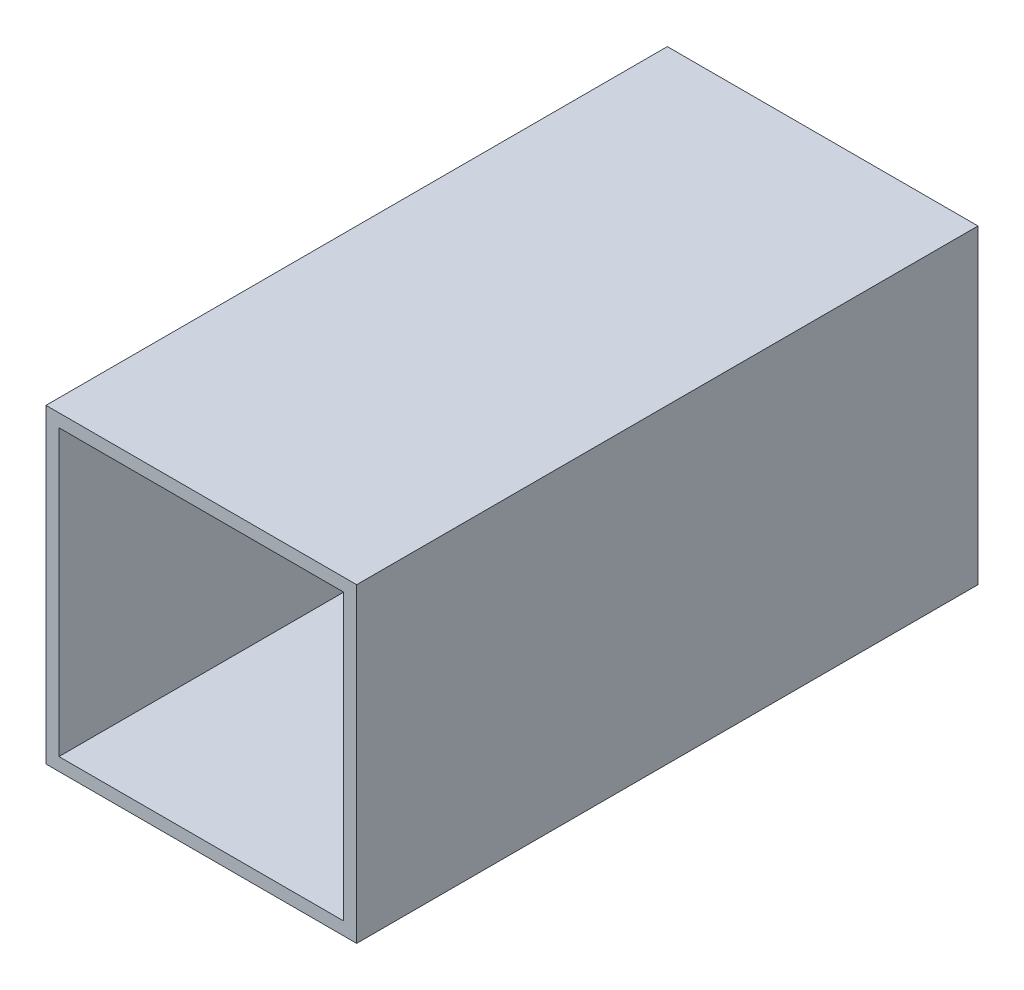
ISO-10303-21;
HEADER;
FILE_DESCRIPTION(('STEP AP214'),'2;1');
FILE_NAME('part.step','',(''),(''),'','','');
FILE_SCHEMA(('AUTOMOTIVE_DESIGN { 1 0 10303 214 1 1 1 1 }'));
ENDSEC;
DATA;
#1=APPLICATION_CONTEXT('core data for automotive mechanical design processes');
#2=APPLICATION_PROTOCOL_DEFINITION('international standard','automotive_design',2000,#1);
#3=PRODUCT_CONTEXT('',#1,'mechanical');
#4=PRODUCT('Part','Part','',(#3));
#5=PRODUCT_RELATED_PRODUCT_CATEGORY('part','',(#4));
#6=PRODUCT_DEFINITION_FORMATION('','',#4);
#7=PRODUCT_DEFINITION_CONTEXT('part definition',#1,'design');
#8=PRODUCT_DEFINITION('design','',#6,#7);
#9=PRODUCT_DEFINITION_SHAPE('','',#8);
#10=(LENGTH_UNIT() NAMED_UNIT(*) SI_UNIT(.MILLI.,.METRE.));
#11=(NAMED_UNIT(*) PLANE_ANGLE_UNIT() SI_UNIT($,.RADIAN.));
#12=(NAMED_UNIT(*) SI_UNIT($,.STERADIAN.) SOLID_ANGLE_UNIT());
#13=UNCERTAINTY_MEASURE_WITH_UNIT(LENGTH_MEASURE(1.E-05),#10,'distance_accuracy_value','');
#14=(GEOMETRIC_REPRESENTATION_CONTEXT(3) GLOBAL_UNCERTAINTY_ASSIGNED_CONTEXT((#13)) GLOBAL_UNIT_ASSIGNED_CONTEXT((#10,
#11,#12)) REPRESENTATION_CONTEXT('',''));
#15=CARTESIAN_POINT('',(0.,0.,0.));
#16=DIRECTION('',(0.,0.,1.));
#17=DIRECTION('',(1.,0.,0.));
#18=AXIS2_PLACEMENT_3D('',#15,#16,#17);
#19=CARTESIAN_POINT('',(-38.1,38.1,-76.2));
#20=DIRECTION('',(-1.,0.,0.));
#21=DIRECTION('',(0.,0.,1.));
#22=AXIS2_PLACEMENT_3D('',#19,#20,#21);
#23=PLANE('',#22);
#24=DIRECTION('',(0.,0.,1.));
#25=VECTOR('',#24,1.);
#26=CARTESIAN_POINT('',(-38.1,-38.1,-76.2));
#27=LINE('',#26,#25);
#28=CARTESIAN_POINT('',(-38.1,-38.1,-76.2));
#29=VERTEX_POINT('',#28);
#30=CARTESIAN_POINT('',(-38.1,-38.1,76.2));
#31=VERTEX_POINT('',#30);
#32=EDGE_CURVE('E36',#29,#31,#27,.T.);
#33=ORIENTED_EDGE('',*,*,#32,.T.);
#34=DIRECTION('',(0.,-1.,0.));
#35=VECTOR('',#34,1.);
#36=CARTESIAN_POINT('',(-38.1,38.1,76.2));
#37=LINE('',#36,#35);
#38=CARTESIAN_POINT('',(-38.1,38.1,76.2));
#39=VERTEX_POINT('',#38);
#40=EDGE_CURVE('E128',#39,#31,#37,.T.);
#41=ORIENTED_EDGE('',*,*,#40,.F.);
#42=DIRECTION('',(0.,0.,1.));
#43=VECTOR('',#42,1.);
#44=CARTESIAN_POINT('',(-38.1,38.1,-76.2));
#45=LINE('',#44,#43);
#46=CARTESIAN_POINT('',(-38.1,38.1,-76.2));
#47=VERTEX_POINT('',#46);
#48=EDGE_CURVE('E11',#47,#39,#45,.T.);
#49=ORIENTED_EDGE('',*,*,#48,.F.);
#50=DIRECTION('',(0.,-1.,0.));
#51=VECTOR('',#50,1.);
#52=CARTESIAN_POINT('',(-38.1,38.1,-76.2));
#53=LINE('',#52,#51);
#54=EDGE_CURVE('E147',#47,#29,#53,.T.);
#55=ORIENTED_EDGE('',*,*,#54,.T.);
#56=EDGE_LOOP('',(#33,#41,#49,#55));
#57=FACE_BOUND('',#56,.T.);
#58=ADVANCED_FACE('F33',(#57),#23,.T.);
#59=CARTESIAN_POINT('',(38.1,38.1,-76.2));
#60=DIRECTION('',(0.,1.,0.));
#61=DIRECTION('',(-1.,0.,0.));
#62=AXIS2_PLACEMENT_3D('',#59,#60,#61);
#63=PLANE('',#62);
#64=ORIENTED_EDGE('',*,*,#48,.T.);
#65=DIRECTION('',(-1.,0.,0.));
#66=VECTOR('',#65,1.);
#67=CARTESIAN_POINT('',(38.1,38.1,76.2));
#68=LINE('',#67,#66);
#69=CARTESIAN_POINT('',(38.1,38.1,76.2));
#70=VERTEX_POINT('',#69);
#71=EDGE_CURVE('E137',#70,#39,#68,.T.);
#72=ORIENTED_EDGE('',*,*,#71,.F.);
#73=DIRECTION('',(0.,0.,1.));
#74=VECTOR('',#73,1.);
#75=CARTESIAN_POINT('',(38.1,38.1,-76.2));
#76=LINE('',#75,#74);
#77=CARTESIAN_POINT('',(38.1,38.1,-76.2));
#78=VERTEX_POINT('',#77);
#79=EDGE_CURVE('E41',#78,#70,#76,.T.);
#80=ORIENTED_EDGE('',*,*,#79,.F.);
#81=DIRECTION('',(-1.,0.,0.));
#82=VECTOR('',#81,1.);
#83=CARTESIAN_POINT('',(38.1,38.1,-76.2));
#84=LINE('',#83,#82);
#85=EDGE_CURVE('E158',#78,#47,#84,.T.);
#86=ORIENTED_EDGE('',*,*,#85,.T.);
#87=EDGE_LOOP('',(#64,#72,#80,#86));
#88=FACE_BOUND('',#87,.T.);
#89=ADVANCED_FACE('F170',(#88),#63,.T.);
#90=CARTESIAN_POINT('',(38.1,-38.1,-76.2));
#91=DIRECTION('',(1.,0.,0.));
#92=DIRECTION('',(0.,0.,-1.));
#93=AXIS2_PLACEMENT_3D('',#90,#91,#92);
#94=PLANE('',#93);
#95=ORIENTED_EDGE('',*,*,#79,.T.);
#96=DIRECTION('',(0.,1.,0.));
#97=VECTOR('',#96,1.);
#98=CARTESIAN_POINT('',(38.1,-38.1,76.2));
#99=LINE('',#98,#97);
#100=CARTESIAN_POINT('',(38.1,-38.1,76.2));
#101=VERTEX_POINT('',#100);
#102=EDGE_CURVE('E134',#101,#70,#99,.T.);
#103=ORIENTED_EDGE('',*,*,#102,.F.);
#104=DIRECTION('',(0.,0.,1.));
#105=VECTOR('',#104,1.);
#106=CARTESIAN_POINT('',(38.1,-38.1,-76.2));
#107=LINE('',#106,#105);
#108=CARTESIAN_POINT('',(38.1,-38.1,-76.2));
#109=VERTEX_POINT('',#108);
#110=EDGE_CURVE('E161',#109,#101,#107,.T.);
#111=ORIENTED_EDGE('',*,*,#110,.F.);
#112=DIRECTION('',(0.,1.,0.));
#113=VECTOR('',#112,1.);
#114=CARTESIAN_POINT('',(38.1,-38.1,-76.2));
#115=LINE('',#114,#113);
#116=EDGE_CURVE('E155',#109,#78,#115,.T.);
#117=ORIENTED_EDGE('',*,*,#116,.T.);
#118=EDGE_LOOP('',(#95,#103,#111,#117));
#119=FACE_BOUND('',#118,.T.);
#120=ADVANCED_FACE('F176',(#119),#94,.T.);
#121=CARTESIAN_POINT('',(-38.1,-38.1,-76.2));
#122=DIRECTION('',(0.,-1.,0.));
#123=DIRECTION('',(1.,0.,0.));
#124=AXIS2_PLACEMENT_3D('',#121,#122,#123);
#125=PLANE('',#124);
#126=ORIENTED_EDGE('',*,*,#110,.T.);
#127=DIRECTION('',(1.,0.,0.));
#128=VECTOR('',#127,1.);
#129=CARTESIAN_POINT('',(-38.1,-38.1,76.2));
#130=LINE('',#129,#128);
#131=EDGE_CURVE('E131',#31,#101,#130,.T.);
#132=ORIENTED_EDGE('',*,*,#131,.F.);
#133=ORIENTED_EDGE('',*,*,#32,.F.);
#134=DIRECTION('',(1.,0.,0.));
#135=VECTOR('',#134,1.);
#136=CARTESIAN_POINT('',(-38.1,-38.1,-76.2));
#137=LINE('',#136,#135);
#138=EDGE_CURVE('E152',#29,#109,#137,.T.);
#139=ORIENTED_EDGE('',*,*,#138,.T.);
#140=EDGE_LOOP('',(#126,#132,#133,#139));
#141=FACE_BOUND('',#140,.T.);
#142=ADVANCED_FACE('F165',(#141),#125,.T.);
#143=CARTESIAN_POINT('',(0.,0.,-76.2));
#144=DIRECTION('',(0.,0.,1.));
#145=DIRECTION('',(1.,0.,0.));
#146=AXIS2_PLACEMENT_3D('',#143,#144,#145);
#147=PLANE('',#146);
#148=DIRECTION('',(-1.,0.,0.));
#149=VECTOR('',#148,1.);
#150=CARTESIAN_POINT('',(34.925,34.925,-76.2));
#151=LINE('',#150,#149);
#152=CARTESIAN_POINT('',(34.925,34.925,-76.2));
#153=VERTEX_POINT('',#152);
#154=CARTESIAN_POINT('',(-34.925,34.925,-76.2));
#155=VERTEX_POINT('',#154);
#156=EDGE_CURVE('E110',#153,#155,#151,.T.);
#157=ORIENTED_EDGE('',*,*,#156,.T.);
#158=DIRECTION('',(0.,-1.,0.));
#159=VECTOR('',#158,1.);
#160=CARTESIAN_POINT('',(-34.925,34.925,-76.2));
#161=LINE('',#160,#159);
#162=CARTESIAN_POINT('',(-34.925,-34.925,-76.2));
#163=VERTEX_POINT('',#162);
#164=EDGE_CURVE('E140',#155,#163,#161,.T.);
#165=ORIENTED_EDGE('',*,*,#164,.T.);
#166=DIRECTION('',(1.,0.,0.));
#167=VECTOR('',#166,1.);
#168=CARTESIAN_POINT('',(-34.925,-34.925,-76.2));
#169=LINE('',#168,#167);
#170=CARTESIAN_POINT('',(34.925,-34.925,-76.2));
#171=VERTEX_POINT('',#170);
#172=EDGE_CURVE('E105',#163,#171,#169,.T.);
#173=ORIENTED_EDGE('',*,*,#172,.T.);
#174=DIRECTION('',(0.,1.,0.));
#175=VECTOR('',#174,1.);
#176=CARTESIAN_POINT('',(34.925,-34.925,-76.2));
#177=LINE('',#176,#175);
#178=EDGE_CURVE('E49',#171,#153,#177,.T.);
#179=ORIENTED_EDGE('',*,*,#178,.T.);
#180=EDGE_LOOP('',(#157,#165,#173,#179));
#181=FACE_BOUND('',#180,.T.);
#182=ORIENTED_EDGE('',*,*,#54,.F.);
#183=ORIENTED_EDGE('',*,*,#85,.F.);
#184=ORIENTED_EDGE('',*,*,#116,.F.);
#185=ORIENTED_EDGE('',*,*,#138,.F.);
#186=EDGE_LOOP('',(#182,#183,#184,#185));
#187=FACE_BOUND('',#186,.T.);
#188=ADVANCED_FACE('F174',(#181,#187),#147,.F.);
#189=CARTESIAN_POINT('',(-34.925,34.925,-76.2));
#190=DIRECTION('',(-1.,0.,0.));
#191=DIRECTION('',(0.,-1.,0.));
#192=AXIS2_PLACEMENT_3D('',#189,#190,#191);
#193=PLANE('',#192);
#194=DIRECTION('',(0.,0.,1.));
#195=VECTOR('',#194,1.);
#196=CARTESIAN_POINT('',(-34.925,34.925,-76.2));
#197=LINE('',#196,#195);
#198=CARTESIAN_POINT('',(-34.925,34.925,76.2));
#199=VERTEX_POINT('',#198);
#200=EDGE_CURVE('E115',#155,#199,#197,.T.);
#201=ORIENTED_EDGE('',*,*,#200,.T.);
#202=DIRECTION('',(0.,-1.,0.));
#203=VECTOR('',#202,1.);
#204=CARTESIAN_POINT('',(-34.925,34.925,76.2));
#205=LINE('',#204,#203);
#206=CARTESIAN_POINT('',(-34.925,-34.925,76.2));
#207=VERTEX_POINT('',#206);
#208=EDGE_CURVE('E113',#199,#207,#205,.T.);
#209=ORIENTED_EDGE('',*,*,#208,.T.);
#210=DIRECTION('',(0.,0.,1.));
#211=VECTOR('',#210,1.);
#212=CARTESIAN_POINT('',(-34.925,-34.925,-76.2));
#213=LINE('',#212,#211);
#214=EDGE_CURVE('E98',#163,#207,#213,.T.);
#215=ORIENTED_EDGE('',*,*,#214,.F.);
#216=ORIENTED_EDGE('',*,*,#164,.F.);
#217=EDGE_LOOP('',(#201,#209,#215,#216));
#218=FACE_BOUND('',#217,.T.);
#219=ADVANCED_FACE('F114',(#218),#193,.F.);
#220=CARTESIAN_POINT('',(34.925,34.925,-76.2));
#221=DIRECTION('',(0.,1.,0.));
#222=DIRECTION('',(0.,0.,1.));
#223=AXIS2_PLACEMENT_3D('',#220,#221,#222);
#224=PLANE('',#223);
#225=DIRECTION('',(0.,0.,1.));
#226=VECTOR('',#225,1.);
#227=CARTESIAN_POINT('',(34.925,34.925,-76.2));
#228=LINE('',#227,#226);
#229=CARTESIAN_POINT('',(34.925,34.925,76.2));
#230=VERTEX_POINT('',#229);
#231=EDGE_CURVE('E148',#153,#230,#228,.T.);
#232=ORIENTED_EDGE('',*,*,#231,.T.);
#233=DIRECTION('',(-1.,0.,0.));
#234=VECTOR('',#233,1.);
#235=CARTESIAN_POINT('',(34.925,34.925,76.2));
#236=LINE('',#235,#234);
#237=EDGE_CURVE('E124',#230,#199,#236,.T.);
#238=ORIENTED_EDGE('',*,*,#237,.T.);
#239=ORIENTED_EDGE('',*,*,#200,.F.);
#240=ORIENTED_EDGE('',*,*,#156,.F.);
#241=EDGE_LOOP('',(#232,#238,#239,#240));
#242=FACE_BOUND('',#241,.T.);
#243=ADVANCED_FACE('F219',(#242),#224,.F.);
#244=CARTESIAN_POINT('',(34.925,-34.925,-76.2));
#245=DIRECTION('',(1.,0.,0.));
#246=DIRECTION('',(0.,1.,0.));
#247=AXIS2_PLACEMENT_3D('',#244,#245,#246);
#248=PLANE('',#247);
#249=DIRECTION('',(0.,0.,1.));
#250=VECTOR('',#249,1.);
#251=CARTESIAN_POINT('',(34.925,-34.925,-76.2));
#252=LINE('',#251,#250);
#253=CARTESIAN_POINT('',(34.925,-34.925,76.2));
#254=VERTEX_POINT('',#253);
#255=EDGE_CURVE('E109',#171,#254,#252,.T.);
#256=ORIENTED_EDGE('',*,*,#255,.T.);
#257=DIRECTION('',(0.,1.,0.));
#258=VECTOR('',#257,1.);
#259=CARTESIAN_POINT('',(34.925,-34.925,76.2));
#260=LINE('',#259,#258);
#261=EDGE_CURVE('E122',#254,#230,#260,.T.);
#262=ORIENTED_EDGE('',*,*,#261,.T.);
#263=ORIENTED_EDGE('',*,*,#231,.F.);
#264=ORIENTED_EDGE('',*,*,#178,.F.);
#265=EDGE_LOOP('',(#256,#262,#263,#264));
#266=FACE_BOUND('',#265,.T.);
#267=ADVANCED_FACE('F228',(#266),#248,.F.);
#268=CARTESIAN_POINT('',(-34.925,-34.925,-76.2));
#269=DIRECTION('',(0.,-1.,0.));
#270=DIRECTION('',(0.,0.,-1.));
#271=AXIS2_PLACEMENT_3D('',#268,#269,#270);
#272=PLANE('',#271);
#273=ORIENTED_EDGE('',*,*,#214,.T.);
#274=DIRECTION('',(1.,0.,0.));
#275=VECTOR('',#274,1.);
#276=CARTESIAN_POINT('',(-34.925,-34.925,76.2));
#277=LINE('',#276,#275);
#278=EDGE_CURVE('E102',#207,#254,#277,.T.);
#279=ORIENTED_EDGE('',*,*,#278,.T.);
#280=ORIENTED_EDGE('',*,*,#255,.F.);
#281=ORIENTED_EDGE('',*,*,#172,.F.);
#282=EDGE_LOOP('',(#273,#279,#280,#281));
#283=FACE_BOUND('',#282,.T.);
#284=ADVANCED_FACE('F100',(#283),#272,.F.);
#285=CARTESIAN_POINT('',(0.,0.,76.2));
#286=DIRECTION('',(0.,0.,1.));
#287=DIRECTION('',(1.,0.,0.));
#288=AXIS2_PLACEMENT_3D('',#285,#286,#287);
#289=PLANE('',#288);
#290=ORIENTED_EDGE('',*,*,#40,.T.);
#291=ORIENTED_EDGE('',*,*,#131,.T.);
#292=ORIENTED_EDGE('',*,*,#102,.T.);
#293=ORIENTED_EDGE('',*,*,#71,.T.);
#294=EDGE_LOOP('',(#290,#291,#292,#293));
#295=FACE_BOUND('',#294,.T.);
#296=ORIENTED_EDGE('',*,*,#278,.F.);
#297=ORIENTED_EDGE('',*,*,#208,.F.);
#298=ORIENTED_EDGE('',*,*,#237,.F.);
#299=ORIENTED_EDGE('',*,*,#261,.F.);
#300=EDGE_LOOP('',(#296,#297,#298,#299));
#301=FACE_BOUND('',#300,.T.);
#302=ADVANCED_FACE('F120',(#295,#301),#289,.T.);
#303=CLOSED_SHELL('',(#58,#89,#120,#142,#188,#219,#243,#267,#284,#302));
#304=MANIFOLD_SOLID_BREP('B2',#303);
#305=ADVANCED_BREP_SHAPE_REPRESENTATION('',(#18,#304),#14);
#306=SHAPE_DEFINITION_REPRESENTATION(#9,#305);
ENDSEC;
END-ISO-10303-21;
